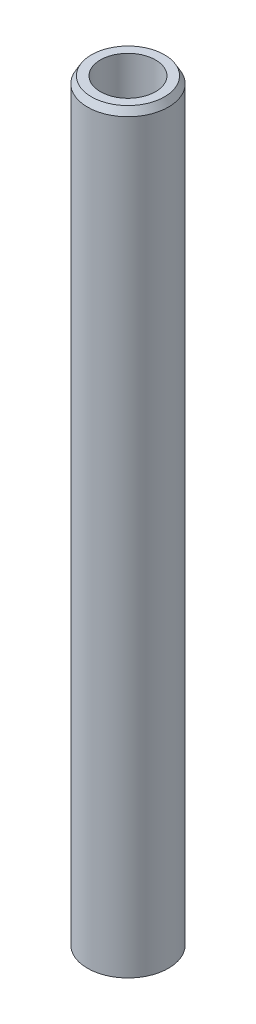
ISO-10303-21;
HEADER;
FILE_DESCRIPTION(('STEP AP214'),'2;1');
FILE_NAME('part.step','',(''),(''),'','','');
FILE_SCHEMA(('AUTOMOTIVE_DESIGN { 1 0 10303 214 1 1 1 1 }'));
ENDSEC;
DATA;
#1=APPLICATION_CONTEXT('core data for automotive mechanical design processes');
#2=APPLICATION_PROTOCOL_DEFINITION('international standard','automotive_design',2000,#1);
#3=PRODUCT_CONTEXT('',#1,'mechanical');
#4=PRODUCT('Part','Part','',(#3));
#5=PRODUCT_RELATED_PRODUCT_CATEGORY('part','',(#4));
#6=PRODUCT_DEFINITION_FORMATION('','',#4);
#7=PRODUCT_DEFINITION_CONTEXT('part definition',#1,'design');
#8=PRODUCT_DEFINITION('design','',#6,#7);
#9=PRODUCT_DEFINITION_SHAPE('','',#8);
#10=(LENGTH_UNIT() NAMED_UNIT(*) SI_UNIT(.MILLI.,.METRE.));
#11=(NAMED_UNIT(*) PLANE_ANGLE_UNIT() SI_UNIT($,.RADIAN.));
#12=(NAMED_UNIT(*) SI_UNIT($,.STERADIAN.) SOLID_ANGLE_UNIT());
#13=UNCERTAINTY_MEASURE_WITH_UNIT(LENGTH_MEASURE(1.E-05),#10,'distance_accuracy_value','');
#14=(GEOMETRIC_REPRESENTATION_CONTEXT(3) GLOBAL_UNCERTAINTY_ASSIGNED_CONTEXT((#13)) GLOBAL_UNIT_ASSIGNED_CONTEXT((#10,
#11,#12)) REPRESENTATION_CONTEXT('',''));
#15=CARTESIAN_POINT('',(0.,0.,0.));
#16=DIRECTION('',(0.,0.,1.));
#17=DIRECTION('',(1.,0.,0.));
#18=AXIS2_PLACEMENT_3D('',#15,#16,#17);
#19=CARTESIAN_POINT('',(0.,561.014777907459,0.));
#20=DIRECTION('',(0.,-1.,0.));
#21=DIRECTION('',(0.,0.,-1.));
#22=AXIS2_PLACEMENT_3D('',#19,#20,#21);
#23=CYLINDRICAL_SURFACE('',#22,30.);
#24=CARTESIAN_POINT('',(0.,555.917930206121,0.));
#25=DIRECTION('',(0.,1.,0.));
#26=DIRECTION('',(0.,0.,1.));
#27=AXIS2_PLACEMENT_3D('',#24,#25,#26);
#28=CIRCLE('',#27,30.);
#29=CARTESIAN_POINT('',(0.,555.917930206121,30.));
#30=VERTEX_POINT('',#29);
#31=EDGE_CURVE('E50',#30,#30,#28,.F.);
#32=ORIENTED_EDGE('',*,*,#31,.T.);
#33=EDGE_LOOP('',(#32));
#34=FACE_BOUND('',#33,.T.);
#35=CARTESIAN_POINT('',(0.,2.94266639238616,0.));
#36=DIRECTION('',(0.,1.,0.));
#37=DIRECTION('',(0.,0.,1.));
#38=AXIS2_PLACEMENT_3D('',#35,#36,#37);
#39=CIRCLE('',#38,30.);
#40=CARTESIAN_POINT('',(0.,2.94266639238616,30.));
#41=VERTEX_POINT('',#40);
#42=EDGE_CURVE('E51',#41,#41,#39,.T.);
#43=ORIENTED_EDGE('',*,*,#42,.T.);
#44=EDGE_LOOP('',(#43));
#45=FACE_BOUND('',#44,.T.);
#46=ADVANCED_FACE('F39',(#34,#45),#23,.T.);
#47=CARTESIAN_POINT('',(0.,561.014777907459,0.));
#48=DIRECTION('',(0.,1.,0.));
#49=DIRECTION('',(0.,0.,1.));
#50=AXIS2_PLACEMENT_3D('',#47,#48,#49);
#51=PLANE('',#50);
#52=CARTESIAN_POINT('',(0.,561.014777907459,0.));
#53=DIRECTION('',(0.,1.,0.));
#54=DIRECTION('',(0.,0.,1.));
#55=AXIS2_PLACEMENT_3D('',#52,#53,#54);
#56=CIRCLE('',#55,27.0573336076138);
#57=CARTESIAN_POINT('',(0.,561.014777907459,27.0573336076138));
#58=VERTEX_POINT('',#57);
#59=EDGE_CURVE('E54',#58,#58,#56,.T.);
#60=ORIENTED_EDGE('',*,*,#59,.T.);
#61=EDGE_LOOP('',(#60));
#62=FACE_BOUND('',#61,.T.);
#63=CARTESIAN_POINT('',(0.,561.014777907459,0.));
#64=DIRECTION('',(0.,1.,0.));
#65=DIRECTION('',(0.,0.,1.));
#66=AXIS2_PLACEMENT_3D('',#63,#64,#65);
#67=CIRCLE('',#66,20.4445522292057);
#68=CARTESIAN_POINT('',(0.,561.014777907459,20.4445522292057));
#69=VERTEX_POINT('',#68);
#70=EDGE_CURVE('E58',#69,#69,#67,.T.);
#71=ORIENTED_EDGE('',*,*,#70,.F.);
#72=EDGE_LOOP('',(#71));
#73=FACE_BOUND('',#72,.T.);
#74=ADVANCED_FACE('F69',(#62,#73),#51,.T.);
#75=CARTESIAN_POINT('',(0.,0.,0.));
#76=DIRECTION('',(0.,1.,0.));
#77=DIRECTION('',(0.,0.,1.));
#78=AXIS2_PLACEMENT_3D('',#75,#76,#77);
#79=PLANE('',#78);
#80=CARTESIAN_POINT('',(0.,0.,0.));
#81=DIRECTION('',(0.,1.,0.));
#82=DIRECTION('',(0.,0.,1.));
#83=AXIS2_PLACEMENT_3D('',#80,#81,#82);
#84=CIRCLE('',#83,24.9031522986616);
#85=CARTESIAN_POINT('',(0.,0.,24.9031522986616));
#86=VERTEX_POINT('',#85);
#87=EDGE_CURVE('E10',#86,#86,#84,.F.);
#88=ORIENTED_EDGE('',*,*,#87,.T.);
#89=EDGE_LOOP('',(#88));
#90=FACE_BOUND('',#89,.T.);
#91=CARTESIAN_POINT('',(0.,0.,0.));
#92=DIRECTION('',(0.,1.,0.));
#93=DIRECTION('',(0.,0.,1.));
#94=AXIS2_PLACEMENT_3D('',#91,#92,#93);
#95=CIRCLE('',#94,20.4445522292057);
#96=CARTESIAN_POINT('',(0.,0.,20.4445522292057));
#97=VERTEX_POINT('',#96);
#98=EDGE_CURVE('E63',#97,#97,#95,.T.);
#99=ORIENTED_EDGE('',*,*,#98,.T.);
#100=EDGE_LOOP('',(#99));
#101=FACE_BOUND('',#100,.T.);
#102=ADVANCED_FACE('F75',(#90,#101),#79,.F.);
#103=CARTESIAN_POINT('',(0.,561.014777907459,0.));
#104=DIRECTION('',(0.,-1.,0.));
#105=DIRECTION('',(0.,0.,-1.));
#106=AXIS2_PLACEMENT_3D('',#103,#104,#105);
#107=CYLINDRICAL_SURFACE('',#106,20.4445522292057);
#108=ORIENTED_EDGE('',*,*,#70,.T.);
#109=EDGE_LOOP('',(#108));
#110=FACE_BOUND('',#109,.T.);
#111=ORIENTED_EDGE('',*,*,#98,.F.);
#112=EDGE_LOOP('',(#111));
#113=FACE_BOUND('',#112,.T.);
#114=ADVANCED_FACE('F70',(#110,#113),#107,.F.);
#115=CARTESIAN_POINT('',(0.,561.014777907459,0.));
#116=DIRECTION('',(0.,-1.,0.));
#117=DIRECTION('',(0.,0.,-1.));
#118=AXIS2_PLACEMENT_3D('',#115,#116,#117);
#119=CONICAL_SURFACE('',#118,27.0573336076138,0.523598775598295);
#120=ORIENTED_EDGE('',*,*,#31,.F.);
#121=EDGE_LOOP('',(#120));
#122=FACE_BOUND('',#121,.T.);
#123=ORIENTED_EDGE('',*,*,#59,.F.);
#124=EDGE_LOOP('',(#123));
#125=FACE_BOUND('',#124,.T.);
#126=ADVANCED_FACE('F81',(#122,#125),#119,.T.);
#127=CARTESIAN_POINT('',(0.,2.94266639238616,0.));
#128=DIRECTION('',(0.,1.,0.));
#129=DIRECTION('',(0.,0.,1.));
#130=AXIS2_PLACEMENT_3D('',#127,#128,#129);
#131=CONICAL_SURFACE('',#130,30.,1.04719755119661);
#132=ORIENTED_EDGE('',*,*,#87,.F.);
#133=EDGE_LOOP('',(#132));
#134=FACE_BOUND('',#133,.T.);
#135=ORIENTED_EDGE('',*,*,#42,.F.);
#136=EDGE_LOOP('',(#135));
#137=FACE_BOUND('',#136,.T.);
#138=ADVANCED_FACE('F45',(#134,#137),#131,.T.);
#139=CLOSED_SHELL('',(#46,#74,#102,#114,#126,#138));
#140=MANIFOLD_SOLID_BREP('B2',#139);
#141=ADVANCED_BREP_SHAPE_REPRESENTATION('',(#18,#140),#14);
#142=SHAPE_DEFINITION_REPRESENTATION(#9,#141);
ENDSEC;
END-ISO-10303-21;
